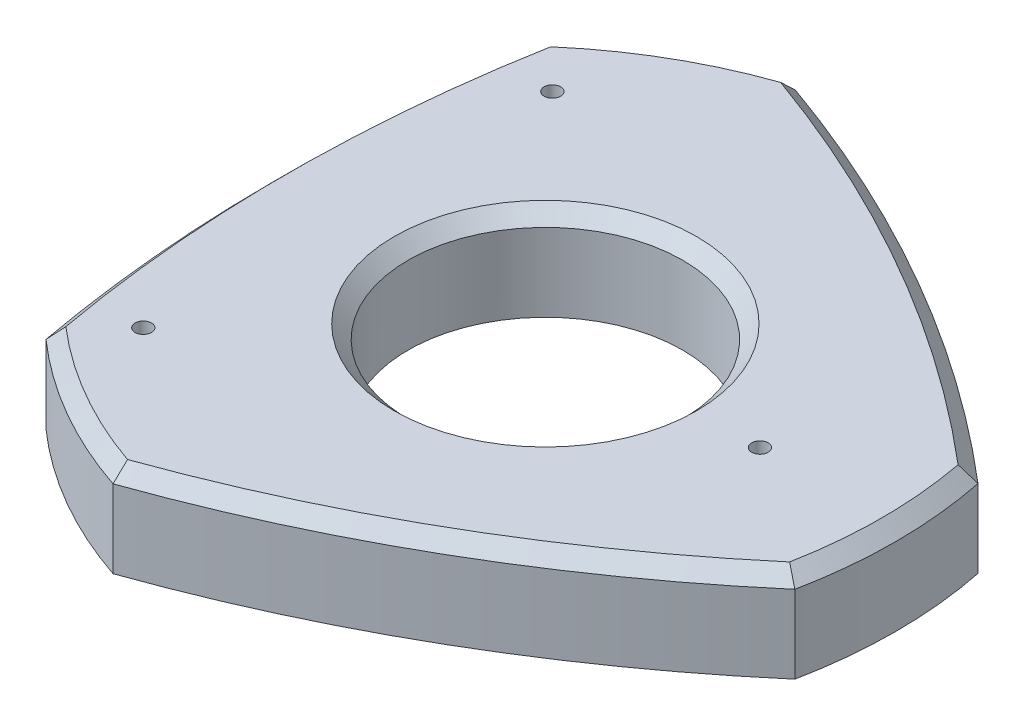
ISO-10303-21;
HEADER;
FILE_DESCRIPTION(('STEP AP214'),'2;1');
FILE_NAME('part.step','',(''),(''),'','','');
FILE_SCHEMA(('AUTOMOTIVE_DESIGN { 1 0 10303 214 1 1 1 1 }'));
ENDSEC;
DATA;
#1=APPLICATION_CONTEXT('core data for automotive mechanical design processes');
#2=APPLICATION_PROTOCOL_DEFINITION('international standard','automotive_design',2000,#1);
#3=PRODUCT_CONTEXT('',#1,'mechanical');
#4=PRODUCT('Part','Part','',(#3));
#5=PRODUCT_RELATED_PRODUCT_CATEGORY('part','',(#4));
#6=PRODUCT_DEFINITION_FORMATION('','',#4);
#7=PRODUCT_DEFINITION_CONTEXT('part definition',#1,'design');
#8=PRODUCT_DEFINITION('design','',#6,#7);
#9=PRODUCT_DEFINITION_SHAPE('','',#8);
#10=(LENGTH_UNIT() NAMED_UNIT(*) SI_UNIT(.MILLI.,.METRE.));
#11=(NAMED_UNIT(*) PLANE_ANGLE_UNIT() SI_UNIT($,.RADIAN.));
#12=(NAMED_UNIT(*) SI_UNIT($,.STERADIAN.) SOLID_ANGLE_UNIT());
#13=UNCERTAINTY_MEASURE_WITH_UNIT(LENGTH_MEASURE(1.E-05),#10,'distance_accuracy_value','');
#14=(GEOMETRIC_REPRESENTATION_CONTEXT(3) GLOBAL_UNCERTAINTY_ASSIGNED_CONTEXT((#13)) GLOBAL_UNIT_ASSIGNED_CONTEXT((#10,
#11,#12)) REPRESENTATION_CONTEXT('',''));
#15=CARTESIAN_POINT('',(0.,0.,0.));
#16=DIRECTION('',(0.,0.,1.));
#17=DIRECTION('',(1.,0.,0.));
#18=AXIS2_PLACEMENT_3D('',#15,#16,#17);
#19=CARTESIAN_POINT('',(-53.8608960717601,20.,114.526323512135));
#20=DIRECTION('',(0.,-1.,0.));
#21=DIRECTION('',(0.,0.,-1.));
#22=AXIS2_PLACEMENT_3D('',#19,#20,#21);
#23=PLANE('',#22);
#24=CARTESIAN_POINT('',(-43.1454340306012,20.,-44.6703261366643));
#25=DIRECTION('',(0.,1.,0.));
#26=DIRECTION('',(0.,0.,1.));
#27=AXIS2_PLACEMENT_3D('',#24,#25,#26);
#28=CIRCLE('',#27,1.79999999999999);
#29=CARTESIAN_POINT('',(-43.1454340306012,20.,-42.8703261366643));
#30=VERTEX_POINT('',#29);
#31=EDGE_CURVE('E385',#30,#30,#28,.T.);
#32=ORIENTED_EDGE('',*,*,#31,.F.);
#33=EDGE_LOOP('',(#32));
#34=FACE_BOUND('',#33,.T.);
#35=CARTESIAN_POINT('',(-43.1454340306012,20.,44.6703261366643));
#36=DIRECTION('',(0.,1.,0.));
#37=DIRECTION('',(0.,0.,1.));
#38=AXIS2_PLACEMENT_3D('',#35,#36,#37);
#39=CIRCLE('',#38,1.79999999999999);
#40=CARTESIAN_POINT('',(-43.1454340306012,20.,46.4703261366643));
#41=VERTEX_POINT('',#40);
#42=EDGE_CURVE('E377',#41,#41,#39,.T.);
#43=ORIENTED_EDGE('',*,*,#42,.F.);
#44=EDGE_LOOP('',(#43));
#45=FACE_BOUND('',#44,.T.);
#46=CARTESIAN_POINT('',(46.8545659693987,20.,0.));
#47=DIRECTION('',(0.,1.,0.));
#48=DIRECTION('',(0.,0.,1.));
#49=AXIS2_PLACEMENT_3D('',#46,#47,#48);
#50=CIRCLE('',#49,1.79999999999999);
#51=CARTESIAN_POINT('',(46.8545659693987,20.,1.79999999999999));
#52=VERTEX_POINT('',#51);
#53=EDGE_CURVE('E370',#52,#52,#50,.T.);
#54=ORIENTED_EDGE('',*,*,#53,.F.);
#55=EDGE_LOOP('',(#54));
#56=FACE_BOUND('',#55,.T.);
#57=CARTESIAN_POINT('',(0.,20.,0.));
#58=DIRECTION('',(0.,-1.,0.));
#59=DIRECTION('',(0.,0.,-1.));
#60=AXIS2_PLACEMENT_3D('',#57,#58,#59);
#61=CIRCLE('',#60,33.);
#62=CARTESIAN_POINT('',(0.,20.,-33.));
#63=VERTEX_POINT('',#62);
#64=EDGE_CURVE('E200',#63,#63,#61,.T.);
#65=ORIENTED_EDGE('',*,*,#64,.T.);
#66=EDGE_LOOP('',(#65));
#67=FACE_BOUND('',#66,.T.);
#68=CARTESIAN_POINT('',(-24.5218152745381,20.,0.));
#69=DIRECTION('',(0.,-1.,0.));
#70=DIRECTION('',(0.,0.,-1.));
#71=AXIS2_PLACEMENT_3D('',#68,#69,#70);
#72=CIRCLE('',#71,98.);
#73=CARTESIAN_POINT('',(71.7365852202343,20.,18.393486189083));
#74=VERTEX_POINT('',#73);
#75=CARTESIAN_POINT('',(71.7365852202344,20.,-18.3934861890828));
#76=VERTEX_POINT('',#75);
#77=EDGE_CURVE('E193',#74,#76,#72,.F.);
#78=ORIENTED_EDGE('',*,*,#77,.T.);
#79=CARTESIAN_POINT('',(-119.98269978079,20.,207.816132049611));
#80=DIRECTION('',(0.,-1.,0.));
#81=DIRECTION('',(0.,0.,-1.));
#82=AXIS2_PLACEMENT_3D('',#79,#80,#81);
#83=CIRCLE('',#82,296.524999999999);
#84=CARTESIAN_POINT('',(-19.9390663062132,20.,-71.3224482760117));
#85=VERTEX_POINT('',#84);
#86=EDGE_CURVE('E196',#76,#85,#83,.F.);
#87=ORIENTED_EDGE('',*,*,#86,.T.);
#88=CARTESIAN_POINT('',(12.2609076372694,20.,21.2365149746599));
#89=DIRECTION('',(0.,-1.,0.));
#90=DIRECTION('',(0.,0.,-1.));
#91=AXIS2_PLACEMENT_3D('',#88,#89,#90);
#92=CIRCLE('',#91,98.0000000000007);
#93=CARTESIAN_POINT('',(-51.7975189140212,20.,-52.9289620869288));
#94=VERTEX_POINT('',#93);
#95=EDGE_CURVE('E181',#85,#94,#92,.F.);
#96=ORIENTED_EDGE('',*,*,#95,.T.);
#97=CARTESIAN_POINT('',(239.965399561571,20.,0.));
#98=DIRECTION('',(0.,-1.,0.));
#99=DIRECTION('',(0.,0.,-1.));
#100=AXIS2_PLACEMENT_3D('',#97,#98,#99);
#101=CIRCLE('',#100,296.524999999991);
#102=CARTESIAN_POINT('',(-51.7975189140212,20.,52.9289620869287));
#103=VERTEX_POINT('',#102);
#104=EDGE_CURVE('E184',#94,#103,#101,.F.);
#105=ORIENTED_EDGE('',*,*,#104,.T.);
#106=CARTESIAN_POINT('',(12.2609076372689,20.,-21.236514974659));
#107=DIRECTION('',(0.,-1.,0.));
#108=DIRECTION('',(0.,0.,-1.));
#109=AXIS2_PLACEMENT_3D('',#106,#107,#108);
#110=CIRCLE('',#109,97.9999999999997);
#111=CARTESIAN_POINT('',(-19.939066306213,20.,71.3224482760117));
#112=VERTEX_POINT('',#111);
#113=EDGE_CURVE('E187',#103,#112,#110,.F.);
#114=ORIENTED_EDGE('',*,*,#113,.T.);
#115=CARTESIAN_POINT('',(-119.98269978079,20.,-207.816132049612));
#116=DIRECTION('',(0.,-1.,0.));
#117=DIRECTION('',(0.,0.,-1.));
#118=AXIS2_PLACEMENT_3D('',#115,#116,#117);
#119=CIRCLE('',#118,296.525);
#120=EDGE_CURVE('E190',#112,#74,#119,.F.);
#121=ORIENTED_EDGE('',*,*,#120,.T.);
#122=EDGE_LOOP('',(#78,#87,#96,#105,#114,#121));
#123=FACE_BOUND('',#122,.T.);
#124=ADVANCED_FACE('F40',(#34,#45,#56,#67,#123),#23,.F.);
#125=CARTESIAN_POINT('',(-53.8608960717601,0.,114.526323512135));
#126=DIRECTION('',(0.,-1.,0.));
#127=DIRECTION('',(0.,0.,-1.));
#128=AXIS2_PLACEMENT_3D('',#125,#126,#127);
#129=PLANE('',#128);
#130=CARTESIAN_POINT('',(-43.1454340306012,0.,-44.6703261366643));
#131=DIRECTION('',(0.,1.,0.));
#132=DIRECTION('',(0.,0.,1.));
#133=AXIS2_PLACEMENT_3D('',#130,#131,#132);
#134=CIRCLE('',#133,1.8);
#135=CARTESIAN_POINT('',(-43.1454340306012,0.,-42.8703261366643));
#136=VERTEX_POINT('',#135);
#137=EDGE_CURVE('E381',#136,#136,#134,.T.);
#138=ORIENTED_EDGE('',*,*,#137,.T.);
#139=EDGE_LOOP('',(#138));
#140=FACE_BOUND('',#139,.T.);
#141=CARTESIAN_POINT('',(-43.1454340306012,0.,44.6703261366643));
#142=DIRECTION('',(0.,1.,0.));
#143=DIRECTION('',(0.,0.,1.));
#144=AXIS2_PLACEMENT_3D('',#141,#142,#143);
#145=CIRCLE('',#144,1.8);
#146=CARTESIAN_POINT('',(-43.1454340306012,0.,46.4703261366643));
#147=VERTEX_POINT('',#146);
#148=EDGE_CURVE('E373',#147,#147,#145,.T.);
#149=ORIENTED_EDGE('',*,*,#148,.T.);
#150=EDGE_LOOP('',(#149));
#151=FACE_BOUND('',#150,.T.);
#152=CARTESIAN_POINT('',(46.8545659693987,0.,0.));
#153=DIRECTION('',(0.,1.,0.));
#154=DIRECTION('',(0.,0.,1.));
#155=AXIS2_PLACEMENT_3D('',#152,#153,#154);
#156=CIRCLE('',#155,1.8);
#157=CARTESIAN_POINT('',(46.8545659693987,0.,1.8));
#158=VERTEX_POINT('',#157);
#159=EDGE_CURVE('E228',#158,#158,#156,.T.);
#160=ORIENTED_EDGE('',*,*,#159,.T.);
#161=EDGE_LOOP('',(#160));
#162=FACE_BOUND('',#161,.T.);
#163=CARTESIAN_POINT('',(12.2609076372694,0.,21.2365149746599));
#164=DIRECTION('',(0.,1.,0.));
#165=DIRECTION('',(0.,0.,-1.));
#166=AXIS2_PLACEMENT_3D('',#163,#164,#165);
#167=CIRCLE('',#166,101.000000000001);
#168=CARTESIAN_POINT('',(-19.9185842870421,0.,-74.5));
#169=VERTEX_POINT('',#168);
#170=CARTESIAN_POINT('',(-54.5596004384196,0.,-54.5));
#171=VERTEX_POINT('',#170);
#172=EDGE_CURVE('E134',#169,#171,#167,.T.);
#173=ORIENTED_EDGE('',*,*,#172,.F.);
#174=CARTESIAN_POINT('',(-119.98269978079,0.,207.816132049611));
#175=DIRECTION('',(0.,1.,0.));
#176=DIRECTION('',(0.,0.,-1.));
#177=AXIS2_PLACEMENT_3D('',#174,#175,#176);
#178=CIRCLE('',#177,299.524999999999);
#179=CARTESIAN_POINT('',(74.4781847254617,0.,-20.));
#180=VERTEX_POINT('',#179);
#181=EDGE_CURVE('E162',#180,#169,#178,.T.);
#182=ORIENTED_EDGE('',*,*,#181,.F.);
#183=CARTESIAN_POINT('',(-24.5218152745381,0.,0.));
#184=DIRECTION('',(0.,1.,0.));
#185=DIRECTION('',(0.,0.,1.));
#186=AXIS2_PLACEMENT_3D('',#183,#184,#185);
#187=CIRCLE('',#186,101.);
#188=CARTESIAN_POINT('',(74.4781847254618,0.,20.));
#189=VERTEX_POINT('',#188);
#190=EDGE_CURVE('E158',#189,#180,#187,.T.);
#191=ORIENTED_EDGE('',*,*,#190,.F.);
#192=CARTESIAN_POINT('',(-119.98269978079,0.,-207.816132049612));
#193=DIRECTION('',(0.,1.,0.));
#194=DIRECTION('',(0.,0.,-1.));
#195=AXIS2_PLACEMENT_3D('',#192,#193,#194);
#196=CIRCLE('',#195,299.525);
#197=CARTESIAN_POINT('',(-19.9185842870421,0.,74.5));
#198=VERTEX_POINT('',#197);
#199=EDGE_CURVE('E154',#198,#189,#196,.T.);
#200=ORIENTED_EDGE('',*,*,#199,.F.);
#201=CARTESIAN_POINT('',(12.2609076372689,0.,-21.236514974659));
#202=DIRECTION('',(0.,1.,0.));
#203=DIRECTION('',(0.,0.,1.));
#204=AXIS2_PLACEMENT_3D('',#201,#202,#203);
#205=CIRCLE('',#204,101.);
#206=CARTESIAN_POINT('',(-54.5596004384197,0.,54.5));
#207=VERTEX_POINT('',#206);
#208=EDGE_CURVE('E137',#207,#198,#205,.T.);
#209=ORIENTED_EDGE('',*,*,#208,.F.);
#210=CARTESIAN_POINT('',(239.965399561571,0.,0.));
#211=DIRECTION('',(0.,1.,0.));
#212=DIRECTION('',(0.,0.,1.));
#213=AXIS2_PLACEMENT_3D('',#210,#211,#212);
#214=CIRCLE('',#213,299.524999999991);
#215=EDGE_CURVE('E120',#171,#207,#214,.T.);
#216=ORIENTED_EDGE('',*,*,#215,.F.);
#217=EDGE_LOOP('',(#173,#182,#191,#200,#209,#216));
#218=FACE_BOUND('',#217,.T.);
#219=CARTESIAN_POINT('',(0.,0.,0.));
#220=DIRECTION('',(0.,1.,0.));
#221=DIRECTION('',(0.,0.,1.));
#222=AXIS2_PLACEMENT_3D('',#219,#220,#221);
#223=CIRCLE('',#222,30.);
#224=CARTESIAN_POINT('',(0.,0.,30.));
#225=VERTEX_POINT('',#224);
#226=EDGE_CURVE('E145',#225,#225,#223,.T.);
#227=ORIENTED_EDGE('',*,*,#226,.T.);
#228=EDGE_LOOP('',(#227));
#229=FACE_BOUND('',#228,.T.);
#230=ADVANCED_FACE('F131',(#140,#151,#162,#218,#229),#129,.T.);
#231=CARTESIAN_POINT('',(12.2609076372694,20.,21.2365149746599));
#232=DIRECTION('',(0.,-1.,0.));
#233=DIRECTION('',(0.,0.,-1.));
#234=AXIS2_PLACEMENT_3D('',#231,#232,#233);
#235=CYLINDRICAL_SURFACE('',#234,101.000000000001);
#236=DIRECTION('',(0.,-1.,0.));
#237=VECTOR('',#236,1.);
#238=CARTESIAN_POINT('',(-54.5596004384196,20.,-54.5));
#239=LINE('',#238,#237);
#240=CARTESIAN_POINT('',(-54.5596004384196,17.0000000000001,-54.5));
#241=VERTEX_POINT('',#240);
#242=EDGE_CURVE('E117',#241,#171,#239,.T.);
#243=ORIENTED_EDGE('',*,*,#242,.F.);
#244=CARTESIAN_POINT('',(12.2609076372694,17.0000000000001,21.2365149746599));
#245=DIRECTION('',(0.,-1.,0.));
#246=DIRECTION('',(0.,0.,-1.));
#247=AXIS2_PLACEMENT_3D('',#244,#245,#246);
#248=CIRCLE('',#247,101.000000000001);
#249=CARTESIAN_POINT('',(-19.9185842870421,17.0000000000001,-74.5));
#250=VERTEX_POINT('',#249);
#251=EDGE_CURVE('E11',#241,#250,#248,.T.);
#252=ORIENTED_EDGE('',*,*,#251,.T.);
#253=DIRECTION('',(0.,-1.,0.));
#254=VECTOR('',#253,1.);
#255=CARTESIAN_POINT('',(-19.9185842870421,20.,-74.5));
#256=LINE('',#255,#254);
#257=EDGE_CURVE('E142',#250,#169,#256,.T.);
#258=ORIENTED_EDGE('',*,*,#257,.T.);
#259=ORIENTED_EDGE('',*,*,#172,.T.);
#260=EDGE_LOOP('',(#243,#252,#258,#259));
#261=FACE_BOUND('',#260,.T.);
#262=ADVANCED_FACE('F140',(#261),#235,.T.);
#263=CARTESIAN_POINT('',(239.965399561571,20.,0.));
#264=DIRECTION('',(0.,-1.,0.));
#265=DIRECTION('',(0.,0.,-1.));
#266=AXIS2_PLACEMENT_3D('',#263,#264,#265);
#267=CYLINDRICAL_SURFACE('',#266,299.524999999991);
#268=DIRECTION('',(0.,-1.,0.));
#269=VECTOR('',#268,1.);
#270=CARTESIAN_POINT('',(-54.5596004384197,20.,54.5));
#271=LINE('',#270,#269);
#272=CARTESIAN_POINT('',(-54.5596004384197,17.0000000000001,54.5));
#273=VERTEX_POINT('',#272);
#274=EDGE_CURVE('E127',#273,#207,#271,.T.);
#275=ORIENTED_EDGE('',*,*,#274,.F.);
#276=CARTESIAN_POINT('',(239.965399561571,17.0000000000001,0.));
#277=DIRECTION('',(0.,-1.,0.));
#278=DIRECTION('',(0.,0.,-1.));
#279=AXIS2_PLACEMENT_3D('',#276,#277,#278);
#280=CIRCLE('',#279,299.524999999991);
#281=EDGE_CURVE('E56',#273,#241,#280,.T.);
#282=ORIENTED_EDGE('',*,*,#281,.T.);
#283=ORIENTED_EDGE('',*,*,#242,.T.);
#284=ORIENTED_EDGE('',*,*,#215,.T.);
#285=EDGE_LOOP('',(#275,#282,#283,#284));
#286=FACE_BOUND('',#285,.T.);
#287=ADVANCED_FACE('F119',(#286),#267,.T.);
#288=CARTESIAN_POINT('',(12.2609076372689,20.,-21.236514974659));
#289=DIRECTION('',(0.,-1.,0.));
#290=DIRECTION('',(0.,0.,-1.));
#291=AXIS2_PLACEMENT_3D('',#288,#289,#290);
#292=CYLINDRICAL_SURFACE('',#291,101.);
#293=DIRECTION('',(0.,-1.,0.));
#294=VECTOR('',#293,1.);
#295=CARTESIAN_POINT('',(-19.9185842870421,20.,74.5));
#296=LINE('',#295,#294);
#297=CARTESIAN_POINT('',(-19.9185842870421,17.0000000000001,74.5));
#298=VERTEX_POINT('',#297);
#299=EDGE_CURVE('E173',#298,#198,#296,.T.);
#300=ORIENTED_EDGE('',*,*,#299,.F.);
#301=CARTESIAN_POINT('',(12.2609076372689,17.0000000000001,-21.236514974659));
#302=DIRECTION('',(0.,-1.,0.));
#303=DIRECTION('',(0.,0.,-1.));
#304=AXIS2_PLACEMENT_3D('',#301,#302,#303);
#305=CIRCLE('',#304,101.);
#306=EDGE_CURVE('E71',#298,#273,#305,.T.);
#307=ORIENTED_EDGE('',*,*,#306,.T.);
#308=ORIENTED_EDGE('',*,*,#274,.T.);
#309=ORIENTED_EDGE('',*,*,#208,.T.);
#310=EDGE_LOOP('',(#300,#307,#308,#309));
#311=FACE_BOUND('',#310,.T.);
#312=ADVANCED_FACE('F319',(#311),#292,.T.);
#313=CARTESIAN_POINT('',(-119.98269978079,20.,-207.816132049612));
#314=DIRECTION('',(0.,-1.,0.));
#315=DIRECTION('',(0.,0.,-1.));
#316=AXIS2_PLACEMENT_3D('',#313,#314,#315);
#317=CYLINDRICAL_SURFACE('',#316,299.525);
#318=DIRECTION('',(0.,-1.,0.));
#319=VECTOR('',#318,1.);
#320=CARTESIAN_POINT('',(74.4781847254618,20.,20.));
#321=LINE('',#320,#319);
#322=CARTESIAN_POINT('',(74.4781847254618,17.0000000000001,20.));
#323=VERTEX_POINT('',#322);
#324=EDGE_CURVE('E170',#323,#189,#321,.T.);
#325=ORIENTED_EDGE('',*,*,#324,.F.);
#326=CARTESIAN_POINT('',(-119.98269978079,17.0000000000001,-207.816132049612));
#327=DIRECTION('',(0.,-1.,0.));
#328=DIRECTION('',(0.,0.,-1.));
#329=AXIS2_PLACEMENT_3D('',#326,#327,#328);
#330=CIRCLE('',#329,299.525);
#331=EDGE_CURVE('E211',#323,#298,#330,.T.);
#332=ORIENTED_EDGE('',*,*,#331,.T.);
#333=ORIENTED_EDGE('',*,*,#299,.T.);
#334=ORIENTED_EDGE('',*,*,#199,.T.);
#335=EDGE_LOOP('',(#325,#332,#333,#334));
#336=FACE_BOUND('',#335,.T.);
#337=ADVANCED_FACE('F315',(#336),#317,.T.);
#338=CARTESIAN_POINT('',(-24.5218152745381,20.,0.));
#339=DIRECTION('',(0.,-1.,0.));
#340=DIRECTION('',(0.,0.,-1.));
#341=AXIS2_PLACEMENT_3D('',#338,#339,#340);
#342=CYLINDRICAL_SURFACE('',#341,101.);
#343=DIRECTION('',(0.,-1.,0.));
#344=VECTOR('',#343,1.);
#345=CARTESIAN_POINT('',(74.4781847254617,20.,-20.));
#346=LINE('',#345,#344);
#347=CARTESIAN_POINT('',(74.4781847254617,17.0000000000001,-20.));
#348=VERTEX_POINT('',#347);
#349=EDGE_CURVE('E167',#348,#180,#346,.T.);
#350=ORIENTED_EDGE('',*,*,#349,.F.);
#351=CARTESIAN_POINT('',(-24.5218152745381,17.0000000000001,0.));
#352=DIRECTION('',(0.,-1.,0.));
#353=DIRECTION('',(0.,0.,-1.));
#354=AXIS2_PLACEMENT_3D('',#351,#352,#353);
#355=CIRCLE('',#354,101.);
#356=EDGE_CURVE('E208',#348,#323,#355,.T.);
#357=ORIENTED_EDGE('',*,*,#356,.T.);
#358=ORIENTED_EDGE('',*,*,#324,.T.);
#359=ORIENTED_EDGE('',*,*,#190,.T.);
#360=EDGE_LOOP('',(#350,#357,#358,#359));
#361=FACE_BOUND('',#360,.T.);
#362=ADVANCED_FACE('F311',(#361),#342,.T.);
#363=CARTESIAN_POINT('',(-119.98269978079,20.,207.816132049611));
#364=DIRECTION('',(0.,-1.,0.));
#365=DIRECTION('',(0.,0.,-1.));
#366=AXIS2_PLACEMENT_3D('',#363,#364,#365);
#367=CYLINDRICAL_SURFACE('',#366,299.524999999999);
#368=ORIENTED_EDGE('',*,*,#257,.F.);
#369=CARTESIAN_POINT('',(-119.98269978079,17.0000000000001,207.816132049611));
#370=DIRECTION('',(0.,-1.,0.));
#371=DIRECTION('',(0.,0.,-1.));
#372=AXIS2_PLACEMENT_3D('',#369,#370,#371);
#373=CIRCLE('',#372,299.524999999999);
#374=EDGE_CURVE('E204',#250,#348,#373,.T.);
#375=ORIENTED_EDGE('',*,*,#374,.T.);
#376=ORIENTED_EDGE('',*,*,#349,.T.);
#377=ORIENTED_EDGE('',*,*,#181,.T.);
#378=EDGE_LOOP('',(#368,#375,#376,#377));
#379=FACE_BOUND('',#378,.T.);
#380=ADVANCED_FACE('F308',(#379),#367,.T.);
#381=CARTESIAN_POINT('',(0.,20.,0.));
#382=DIRECTION('',(0.,-1.,0.));
#383=DIRECTION('',(0.,0.,-1.));
#384=AXIS2_PLACEMENT_3D('',#381,#382,#383);
#385=CYLINDRICAL_SURFACE('',#384,30.);
#386=CARTESIAN_POINT('',(0.,17.,0.));
#387=DIRECTION('',(0.,-1.,0.));
#388=DIRECTION('',(0.,0.,-1.));
#389=AXIS2_PLACEMENT_3D('',#386,#387,#388);
#390=CIRCLE('',#389,30.);
#391=CARTESIAN_POINT('',(0.,17.,-30.));
#392=VERTEX_POINT('',#391);
#393=EDGE_CURVE('E126',#392,#392,#390,.F.);
#394=ORIENTED_EDGE('',*,*,#393,.T.);
#395=EDGE_LOOP('',(#394));
#396=FACE_BOUND('',#395,.T.);
#397=ORIENTED_EDGE('',*,*,#226,.F.);
#398=EDGE_LOOP('',(#397));
#399=FACE_BOUND('',#398,.T.);
#400=ADVANCED_FACE('F305',(#396,#399),#385,.F.);
#401=CARTESIAN_POINT('',(0.,17.,0.));
#402=DIRECTION('',(0.,1.,0.));
#403=DIRECTION('',(0.,0.,1.));
#404=AXIS2_PLACEMENT_3D('',#401,#402,#403);
#405=CONICAL_SURFACE('',#404,30.,0.785398163397453);
#406=ORIENTED_EDGE('',*,*,#64,.F.);
#407=EDGE_LOOP('',(#406));
#408=FACE_BOUND('',#407,.T.);
#409=ORIENTED_EDGE('',*,*,#393,.F.);
#410=EDGE_LOOP('',(#409));
#411=FACE_BOUND('',#410,.T.);
#412=ADVANCED_FACE('F291',(#408,#411),#405,.F.);
#413=CARTESIAN_POINT('',(12.2609076372689,20.,-21.236514974659));
#414=DIRECTION('',(0.,-1.,0.));
#415=DIRECTION('',(0.,0.,-1.));
#416=AXIS2_PLACEMENT_3D('',#413,#414,#415);
#417=CONICAL_SURFACE('',#416,97.9999999999997,0.785398163397441);
#418=CARTESIAN_POINT('',(-54.5596004384197,17.0000000000001,54.5));
#419=CARTESIAN_POINT('',(-54.09906037192,17.500324056055,54.2391187475239));
#420=CARTESIAN_POINT('',(-53.6386168804541,18.0004860817471,53.9777582964249));
#421=CARTESIAN_POINT('',(-52.7179230389843,19.0004860817532,53.4540789920857));
#422=CARTESIAN_POINT('',(-52.257672688984,19.500324056061,53.1917601388278));
#423=CARTESIAN_POINT('',(-51.7975189140212,20.,52.9289620869288));
#424=B_SPLINE_CURVE_WITH_KNOTS('',3,(#418,#419,#420,#421,#422,#423),.UNSPECIFIED.,.F.,.F.,(4,2,
4),(0.,2.18502080438346,4.37004164961373),.UNSPECIFIED.);
#425=EDGE_CURVE('E268',#273,#103,#424,.T.);
#426=ORIENTED_EDGE('',*,*,#425,.F.);
#427=ORIENTED_EDGE('',*,*,#306,.F.);
#428=CARTESIAN_POINT('',(-19.9185842870421,17.0000000000001,74.5));
#429=CARTESIAN_POINT('',(-19.9229245282767,17.500324056055,73.9707199767127));
#430=CARTESIAN_POINT('',(-19.9268014838132,18.0004860817471,73.4412839905465));
#431=CARTESIAN_POINT('',(-19.9336288235542,19.0004860817532,72.3821000825562));
#432=CARTESIAN_POINT('',(-19.9365792077413,19.500324056061,71.8523521607263));
#433=CARTESIAN_POINT('',(-19.9390663062131,20.,71.3224482760117));
#434=B_SPLINE_CURVE_WITH_KNOTS('',3,(#428,#429,#430,#431,#432,#433),.UNSPECIFIED.,.F.,.F.,(4,2,
4),(0.,2.18502080438346,4.37004164961374),.UNSPECIFIED.);
#435=EDGE_CURVE('E46',#112,#298,#434,.F.);
#436=ORIENTED_EDGE('',*,*,#435,.F.);
#437=ORIENTED_EDGE('',*,*,#113,.F.);
#438=EDGE_LOOP('',(#426,#427,#436,#437));
#439=FACE_BOUND('',#438,.T.);
#440=ADVANCED_FACE('F43',(#439),#417,.T.);
#441=CARTESIAN_POINT('',(-119.98269978079,20.,-207.816132049612));
#442=DIRECTION('',(0.,-1.,0.));
#443=DIRECTION('',(0.,0.,-1.));
#444=AXIS2_PLACEMENT_3D('',#441,#442,#443);
#445=CONICAL_SURFACE('',#444,296.525,0.785398163397444);
#446=ORIENTED_EDGE('',*,*,#435,.T.);
#447=ORIENTED_EDGE('',*,*,#331,.F.);
#448=CARTESIAN_POINT('',(74.4781847254617,17.0000000000001,20.));
#449=CARTESIAN_POINT('',(74.0219849001966,17.500324056055,19.7316012291888));
#450=CARTESIAN_POINT('',(73.5654183642673,18.0004860817471,19.4635256941217));
#451=CARTESIAN_POINT('',(72.6515518625385,19.0004860817532,18.9280210904706));
#452=CARTESIAN_POINT('',(72.1942518967253,19.500324056061,18.6605920218986));
#453=CARTESIAN_POINT('',(71.7365852202343,20.,18.393486189083));
#454=B_SPLINE_CURVE_WITH_KNOTS('',3,(#448,#449,#450,#451,#452,#453),.UNSPECIFIED.,.F.,.F.,(4,2,
4),(0.,2.18502080438344,4.37004164961371),.UNSPECIFIED.);
#455=EDGE_CURVE('E261',#74,#323,#454,.F.);
#456=ORIENTED_EDGE('',*,*,#455,.F.);
#457=ORIENTED_EDGE('',*,*,#120,.F.);
#458=EDGE_LOOP('',(#446,#447,#456,#457));
#459=FACE_BOUND('',#458,.T.);
#460=ADVANCED_FACE('F279',(#459),#445,.T.);
#461=CARTESIAN_POINT('',(239.965399561571,20.,0.));
#462=DIRECTION('',(0.,-1.,0.));
#463=DIRECTION('',(0.,0.,-1.));
#464=AXIS2_PLACEMENT_3D('',#461,#462,#463);
#465=CONICAL_SURFACE('',#464,296.524999999991,0.785398163397444);
#466=ORIENTED_EDGE('',*,*,#425,.T.);
#467=ORIENTED_EDGE('',*,*,#104,.F.);
#468=CARTESIAN_POINT('',(-54.5596004384196,17.0000000000001,-54.5));
#469=CARTESIAN_POINT('',(-54.0990603719199,17.500324056055,-54.239118747524));
#470=CARTESIAN_POINT('',(-53.6386168804541,18.0004860817471,-53.9777582964249));
#471=CARTESIAN_POINT('',(-52.7179230389843,19.0004860817532,-53.4540789920858));
#472=CARTESIAN_POINT('',(-52.257672688984,19.500324056061,-53.1917601388278));
#473=CARTESIAN_POINT('',(-51.7975189140212,20.,-52.9289620869288));
#474=B_SPLINE_CURVE_WITH_KNOTS('',3,(#468,#469,#470,#471,#472,#473),.UNSPECIFIED.,.F.,.F.,(4,2,
4),(0.,2.18502080438345,4.37004164961371),.UNSPECIFIED.);
#475=EDGE_CURVE('E269',#241,#94,#474,.T.);
#476=ORIENTED_EDGE('',*,*,#475,.F.);
#477=ORIENTED_EDGE('',*,*,#281,.F.);
#478=EDGE_LOOP('',(#466,#467,#476,#477));
#479=FACE_BOUND('',#478,.T.);
#480=ADVANCED_FACE('F256',(#479),#465,.T.);
#481=CARTESIAN_POINT('',(-24.5218152745381,20.,0.));
#482=DIRECTION('',(0.,-1.,0.));
#483=DIRECTION('',(0.,0.,-1.));
#484=AXIS2_PLACEMENT_3D('',#481,#482,#483);
#485=CONICAL_SURFACE('',#484,98.,0.785398163397441);
#486=ORIENTED_EDGE('',*,*,#455,.T.);
#487=ORIENTED_EDGE('',*,*,#356,.F.);
#488=CARTESIAN_POINT('',(74.4781847254617,17.0000000000001,-20.));
#489=CARTESIAN_POINT('',(74.0219849001966,17.5003240560549,-19.7316012291886));
#490=CARTESIAN_POINT('',(73.5654183642673,18.0004860817471,-19.4635256941215));
#491=CARTESIAN_POINT('',(72.6515518625386,19.0004860817532,-18.9280210904704));
#492=CARTESIAN_POINT('',(72.1942518967254,19.500324056061,-18.6605920218985));
#493=CARTESIAN_POINT('',(71.7365852202343,20.,-18.3934861890829));
#494=B_SPLINE_CURVE_WITH_KNOTS('',3,(#488,#489,#490,#491,#492,#493),.UNSPECIFIED.,.F.,.F.,(4,2,
4),(0.,2.18502080438345,4.37004164961373),.UNSPECIFIED.);
#495=EDGE_CURVE('E227',#76,#348,#494,.F.);
#496=ORIENTED_EDGE('',*,*,#495,.F.);
#497=ORIENTED_EDGE('',*,*,#77,.F.);
#498=EDGE_LOOP('',(#486,#487,#496,#497));
#499=FACE_BOUND('',#498,.T.);
#500=ADVANCED_FACE('F248',(#499),#485,.T.);
#501=CARTESIAN_POINT('',(12.2609076372694,20.,21.2365149746599));
#502=DIRECTION('',(0.,-1.,0.));
#503=DIRECTION('',(0.,0.,-1.));
#504=AXIS2_PLACEMENT_3D('',#501,#502,#503);
#505=CONICAL_SURFACE('',#504,98.0000000000007,0.785398163397441);
#506=ORIENTED_EDGE('',*,*,#475,.T.);
#507=ORIENTED_EDGE('',*,*,#95,.F.);
#508=CARTESIAN_POINT('',(-19.9390663062132,20.,-71.3224482760117));
#509=CARTESIAN_POINT('',(-19.9365792077414,19.500324056061,-71.8523521607263));
#510=CARTESIAN_POINT('',(-19.9336288235542,19.0004860817532,-72.3821000825562));
#511=CARTESIAN_POINT('',(-19.9268014838132,18.0004860817471,-73.4412839905465));
#512=CARTESIAN_POINT('',(-19.9229245282766,17.500324056055,-73.9707199767127));
#513=CARTESIAN_POINT('',(-19.9185842870421,17.0000000000001,-74.5));
#514=B_SPLINE_CURVE_WITH_KNOTS('',3,(#508,#509,#510,#511,#512,#513),.UNSPECIFIED.,.F.,.F.,(4,2,
4),(0.,2.18502084523027,4.37004164961374),.UNSPECIFIED.);
#515=EDGE_CURVE('E218',#250,#85,#514,.F.);
#516=ORIENTED_EDGE('',*,*,#515,.F.);
#517=ORIENTED_EDGE('',*,*,#251,.F.);
#518=EDGE_LOOP('',(#506,#507,#516,#517));
#519=FACE_BOUND('',#518,.T.);
#520=ADVANCED_FACE('F236',(#519),#505,.T.);
#521=CARTESIAN_POINT('',(-119.98269978079,20.,207.816132049611));
#522=DIRECTION('',(0.,-1.,0.));
#523=DIRECTION('',(0.,0.,-1.));
#524=AXIS2_PLACEMENT_3D('',#521,#522,#523);
#525=CONICAL_SURFACE('',#524,296.524999999999,0.785398163397444);
#526=ORIENTED_EDGE('',*,*,#495,.T.);
#527=ORIENTED_EDGE('',*,*,#374,.F.);
#528=ORIENTED_EDGE('',*,*,#515,.T.);
#529=ORIENTED_EDGE('',*,*,#86,.F.);
#530=EDGE_LOOP('',(#526,#527,#528,#529));
#531=FACE_BOUND('',#530,.T.);
#532=ADVANCED_FACE('F240',(#531),#525,.T.);
#533=CARTESIAN_POINT('',(46.8545659693987,20.,0.));
#534=DIRECTION('',(0.,1.,0.));
#535=DIRECTION('',(0.,0.,1.));
#536=AXIS2_PLACEMENT_3D('',#533,#534,#535);
#537=CYLINDRICAL_SURFACE('',#536,1.79999999999999);
#538=ORIENTED_EDGE('',*,*,#159,.F.);
#539=EDGE_LOOP('',(#538));
#540=FACE_BOUND('',#539,.T.);
#541=ORIENTED_EDGE('',*,*,#53,.T.);
#542=EDGE_LOOP('',(#541));
#543=FACE_BOUND('',#542,.T.);
#544=ADVANCED_FACE('F246',(#540,#543),#537,.F.);
#545=CARTESIAN_POINT('',(-43.1454340306012,20.,44.6703261366643));
#546=DIRECTION('',(0.,1.,0.));
#547=DIRECTION('',(0.,0.,1.));
#548=AXIS2_PLACEMENT_3D('',#545,#546,#547);
#549=CYLINDRICAL_SURFACE('',#548,1.79999999999999);
#550=ORIENTED_EDGE('',*,*,#148,.F.);
#551=EDGE_LOOP('',(#550));
#552=FACE_BOUND('',#551,.T.);
#553=ORIENTED_EDGE('',*,*,#42,.T.);
#554=EDGE_LOOP('',(#553));
#555=FACE_BOUND('',#554,.T.);
#556=ADVANCED_FACE('F392',(#552,#555),#549,.F.);
#557=CARTESIAN_POINT('',(-43.1454340306012,20.,-44.6703261366643));
#558=DIRECTION('',(0.,1.,0.));
#559=DIRECTION('',(0.,0.,1.));
#560=AXIS2_PLACEMENT_3D('',#557,#558,#559);
#561=CYLINDRICAL_SURFACE('',#560,1.79999999999999);
#562=ORIENTED_EDGE('',*,*,#137,.F.);
#563=EDGE_LOOP('',(#562));
#564=FACE_BOUND('',#563,.T.);
#565=ORIENTED_EDGE('',*,*,#31,.T.);
#566=EDGE_LOOP('',(#565));
#567=FACE_BOUND('',#566,.T.);
#568=ADVANCED_FACE('F390',(#564,#567),#561,.F.);
#569=CLOSED_SHELL('',(#124,#230,#262,#287,#312,#337,#362,#380,#400,#412,#440,#460,#480,#500,
#520,#532,#544,#556,#568));
#570=MANIFOLD_SOLID_BREP('B2',#569);
#571=ADVANCED_BREP_SHAPE_REPRESENTATION('',(#18,#570),#14);
#572=SHAPE_DEFINITION_REPRESENTATION(#9,#571);
ENDSEC;
END-ISO-10303-21;
